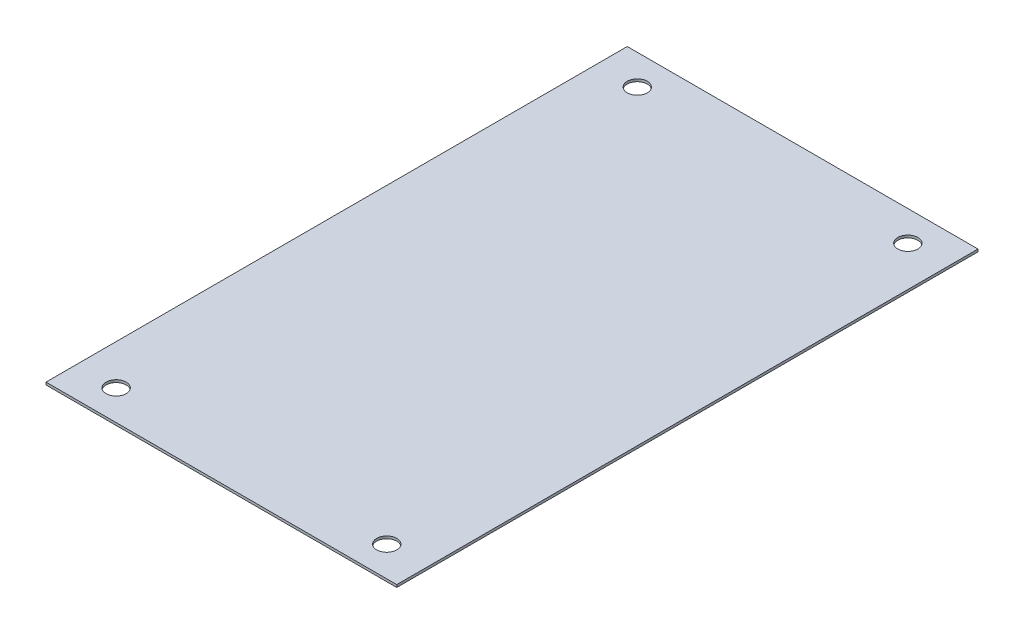
ISO-10303-21;
HEADER;
FILE_DESCRIPTION(('STEP AP214'),'2;1');
FILE_NAME('part.step','',(''),(''),'','','');
FILE_SCHEMA(('AUTOMOTIVE_DESIGN { 1 0 10303 214 1 1 1 1 }'));
ENDSEC;
DATA;
#1=APPLICATION_CONTEXT('core data for automotive mechanical design processes');
#2=APPLICATION_PROTOCOL_DEFINITION('international standard','automotive_design',2000,#1);
#3=PRODUCT_CONTEXT('',#1,'mechanical');
#4=PRODUCT('Part','Part','',(#3));
#5=PRODUCT_RELATED_PRODUCT_CATEGORY('part','',(#4));
#6=PRODUCT_DEFINITION_FORMATION('','',#4);
#7=PRODUCT_DEFINITION_CONTEXT('part definition',#1,'design');
#8=PRODUCT_DEFINITION('design','',#6,#7);
#9=PRODUCT_DEFINITION_SHAPE('','',#8);
#10=(LENGTH_UNIT() NAMED_UNIT(*) SI_UNIT(.MILLI.,.METRE.));
#11=(NAMED_UNIT(*) PLANE_ANGLE_UNIT() SI_UNIT($,.RADIAN.));
#12=(NAMED_UNIT(*) SI_UNIT($,.STERADIAN.) SOLID_ANGLE_UNIT());
#13=UNCERTAINTY_MEASURE_WITH_UNIT(LENGTH_MEASURE(1.E-05),#10,'distance_accuracy_value','');
#14=(GEOMETRIC_REPRESENTATION_CONTEXT(3) GLOBAL_UNCERTAINTY_ASSIGNED_CONTEXT((#13)) GLOBAL_UNIT_ASSIGNED_CONTEXT((#10,
#11,#12)) REPRESENTATION_CONTEXT('',''));
#15=CARTESIAN_POINT('',(0.,0.,0.));
#16=DIRECTION('',(0.,0.,1.));
#17=DIRECTION('',(1.,0.,0.));
#18=AXIS2_PLACEMENT_3D('',#15,#16,#17);
#19=CARTESIAN_POINT('',(0.,3.175,0.));
#20=DIRECTION('',(1.,0.,0.));
#21=DIRECTION('',(0.,0.,-1.));
#22=AXIS2_PLACEMENT_3D('',#19,#20,#21);
#23=PLANE('',#22);
#24=DIRECTION('',(0.,0.,1.));
#25=VECTOR('',#24,1.);
#26=CARTESIAN_POINT('',(0.,0.,0.));
#27=LINE('',#26,#25);
#28=CARTESIAN_POINT('',(0.,0.,-736.6));
#29=VERTEX_POINT('',#28);
#30=CARTESIAN_POINT('',(0.,0.,0.));
#31=VERTEX_POINT('',#30);
#32=EDGE_CURVE('E83',#29,#31,#27,.T.);
#33=ORIENTED_EDGE('',*,*,#32,.T.);
#34=DIRECTION('',(0.,-1.,0.));
#35=VECTOR('',#34,1.);
#36=CARTESIAN_POINT('',(0.,3.175,0.));
#37=LINE('',#36,#35);
#38=CARTESIAN_POINT('',(0.,3.175,0.));
#39=VERTEX_POINT('',#38);
#40=EDGE_CURVE('E11',#39,#31,#37,.T.);
#41=ORIENTED_EDGE('',*,*,#40,.F.);
#42=DIRECTION('',(0.,0.,1.));
#43=VECTOR('',#42,1.);
#44=CARTESIAN_POINT('',(0.,3.175,0.));
#45=LINE('',#44,#43);
#46=CARTESIAN_POINT('',(0.,3.175,-736.6));
#47=VERTEX_POINT('',#46);
#48=EDGE_CURVE('E70',#47,#39,#45,.T.);
#49=ORIENTED_EDGE('',*,*,#48,.F.);
#50=DIRECTION('',(0.,-1.,0.));
#51=VECTOR('',#50,1.);
#52=CARTESIAN_POINT('',(0.,3.175,-736.6));
#53=LINE('',#52,#51);
#54=EDGE_CURVE('E79',#47,#29,#53,.T.);
#55=ORIENTED_EDGE('',*,*,#54,.T.);
#56=EDGE_LOOP('',(#33,#41,#49,#55));
#57=FACE_BOUND('',#56,.T.);
#58=ADVANCED_FACE('F17',(#57),#23,.F.);
#59=CARTESIAN_POINT('',(0.,3.175,0.));
#60=DIRECTION('',(0.,0.,-1.));
#61=DIRECTION('',(-1.,0.,0.));
#62=AXIS2_PLACEMENT_3D('',#59,#60,#61);
#63=PLANE('',#62);
#64=DIRECTION('',(1.,0.,0.));
#65=VECTOR('',#64,1.);
#66=CARTESIAN_POINT('',(0.,0.,0.));
#67=LINE('',#66,#65);
#68=CARTESIAN_POINT('',(444.5,0.,0.));
#69=VERTEX_POINT('',#68);
#70=EDGE_CURVE('E74',#31,#69,#67,.T.);
#71=ORIENTED_EDGE('',*,*,#70,.T.);
#72=DIRECTION('',(0.,-1.,0.));
#73=VECTOR('',#72,1.);
#74=CARTESIAN_POINT('',(444.5,3.175,0.));
#75=LINE('',#74,#73);
#76=CARTESIAN_POINT('',(444.5,3.175,0.));
#77=VERTEX_POINT('',#76);
#78=EDGE_CURVE('E26',#77,#69,#75,.T.);
#79=ORIENTED_EDGE('',*,*,#78,.F.);
#80=DIRECTION('',(1.,0.,0.));
#81=VECTOR('',#80,1.);
#82=CARTESIAN_POINT('',(0.,3.175,0.));
#83=LINE('',#82,#81);
#84=EDGE_CURVE('E65',#39,#77,#83,.T.);
#85=ORIENTED_EDGE('',*,*,#84,.F.);
#86=ORIENTED_EDGE('',*,*,#40,.T.);
#87=EDGE_LOOP('',(#71,#79,#85,#86));
#88=FACE_BOUND('',#87,.T.);
#89=ADVANCED_FACE('F73',(#88),#63,.F.);
#90=CARTESIAN_POINT('',(444.5,3.175,0.));
#91=DIRECTION('',(-1.,0.,0.));
#92=DIRECTION('',(0.,0.,1.));
#93=AXIS2_PLACEMENT_3D('',#90,#91,#92);
#94=PLANE('',#93);
#95=DIRECTION('',(0.,0.,-1.));
#96=VECTOR('',#95,1.);
#97=CARTESIAN_POINT('',(444.5,0.,0.));
#98=LINE('',#97,#96);
#99=CARTESIAN_POINT('',(444.5,0.,-736.6));
#100=VERTEX_POINT('',#99);
#101=EDGE_CURVE('E52',#69,#100,#98,.T.);
#102=ORIENTED_EDGE('',*,*,#101,.T.);
#103=DIRECTION('',(0.,-1.,0.));
#104=VECTOR('',#103,1.);
#105=CARTESIAN_POINT('',(444.5,3.175,-736.6));
#106=LINE('',#105,#104);
#107=CARTESIAN_POINT('',(444.5,3.175,-736.6));
#108=VERTEX_POINT('',#107);
#109=EDGE_CURVE('E75',#108,#100,#106,.T.);
#110=ORIENTED_EDGE('',*,*,#109,.F.);
#111=DIRECTION('',(0.,0.,-1.));
#112=VECTOR('',#111,1.);
#113=CARTESIAN_POINT('',(444.5,3.175,0.));
#114=LINE('',#113,#112);
#115=EDGE_CURVE('E68',#77,#108,#114,.T.);
#116=ORIENTED_EDGE('',*,*,#115,.F.);
#117=ORIENTED_EDGE('',*,*,#78,.T.);
#118=EDGE_LOOP('',(#102,#110,#116,#117));
#119=FACE_BOUND('',#118,.T.);
#120=ADVANCED_FACE('F77',(#119),#94,.F.);
#121=CARTESIAN_POINT('',(0.,3.175,-736.6));
#122=DIRECTION('',(0.,0.,1.));
#123=DIRECTION('',(1.,0.,0.));
#124=AXIS2_PLACEMENT_3D('',#121,#122,#123);
#125=PLANE('',#124);
#126=DIRECTION('',(-1.,0.,0.));
#127=VECTOR('',#126,1.);
#128=CARTESIAN_POINT('',(0.,0.,-736.6));
#129=LINE('',#128,#127);
#130=EDGE_CURVE('E58',#100,#29,#129,.T.);
#131=ORIENTED_EDGE('',*,*,#130,.T.);
#132=ORIENTED_EDGE('',*,*,#54,.F.);
#133=DIRECTION('',(-1.,0.,0.));
#134=VECTOR('',#133,1.);
#135=CARTESIAN_POINT('',(0.,3.175,-736.6));
#136=LINE('',#135,#134);
#137=EDGE_CURVE('E35',#108,#47,#136,.T.);
#138=ORIENTED_EDGE('',*,*,#137,.F.);
#139=ORIENTED_EDGE('',*,*,#109,.T.);
#140=EDGE_LOOP('',(#131,#132,#138,#139));
#141=FACE_BOUND('',#140,.T.);
#142=ADVANCED_FACE('F133',(#141),#125,.F.);
#143=CARTESIAN_POINT('',(0.,3.175,-736.6));
#144=DIRECTION('',(0.,-1.,0.));
#145=DIRECTION('',(0.,0.,-1.));
#146=AXIS2_PLACEMENT_3D('',#143,#144,#145);
#147=PLANE('',#146);
#148=CARTESIAN_POINT('',(50.8,3.175,-38.1));
#149=DIRECTION('',(0.,1.,0.));
#150=DIRECTION('',(0.,0.,1.));
#151=AXIS2_PLACEMENT_3D('',#148,#149,#150);
#152=CIRCLE('',#151,12.7);
#153=CARTESIAN_POINT('',(50.8,3.175,-25.4));
#154=VERTEX_POINT('',#153);
#155=EDGE_CURVE('E112',#154,#154,#152,.T.);
#156=ORIENTED_EDGE('',*,*,#155,.F.);
#157=EDGE_LOOP('',(#156));
#158=FACE_BOUND('',#157,.T.);
#159=CARTESIAN_POINT('',(50.8,3.175,-698.5));
#160=DIRECTION('',(0.,1.,0.));
#161=DIRECTION('',(0.,0.,1.));
#162=AXIS2_PLACEMENT_3D('',#159,#160,#161);
#163=CIRCLE('',#162,12.7);
#164=CARTESIAN_POINT('',(50.8,3.175,-685.8));
#165=VERTEX_POINT('',#164);
#166=EDGE_CURVE('E109',#165,#165,#163,.T.);
#167=ORIENTED_EDGE('',*,*,#166,.F.);
#168=EDGE_LOOP('',(#167));
#169=FACE_BOUND('',#168,.T.);
#170=CARTESIAN_POINT('',(393.7,3.175,-698.5));
#171=DIRECTION('',(0.,1.,0.));
#172=DIRECTION('',(0.,0.,1.));
#173=AXIS2_PLACEMENT_3D('',#170,#171,#172);
#174=CIRCLE('',#173,12.7);
#175=CARTESIAN_POINT('',(393.7,3.175,-685.8));
#176=VERTEX_POINT('',#175);
#177=EDGE_CURVE('E101',#176,#176,#174,.T.);
#178=ORIENTED_EDGE('',*,*,#177,.F.);
#179=EDGE_LOOP('',(#178));
#180=FACE_BOUND('',#179,.T.);
#181=CARTESIAN_POINT('',(393.7,3.175,-38.1));
#182=DIRECTION('',(0.,1.,0.));
#183=DIRECTION('',(0.,0.,1.));
#184=AXIS2_PLACEMENT_3D('',#181,#182,#183);
#185=CIRCLE('',#184,12.7);
#186=CARTESIAN_POINT('',(393.7,3.175,-25.4));
#187=VERTEX_POINT('',#186);
#188=EDGE_CURVE('E92',#187,#187,#185,.T.);
#189=ORIENTED_EDGE('',*,*,#188,.F.);
#190=EDGE_LOOP('',(#189));
#191=FACE_BOUND('',#190,.T.);
#192=ORIENTED_EDGE('',*,*,#48,.T.);
#193=ORIENTED_EDGE('',*,*,#84,.T.);
#194=ORIENTED_EDGE('',*,*,#115,.T.);
#195=ORIENTED_EDGE('',*,*,#137,.T.);
#196=EDGE_LOOP('',(#192,#193,#194,#195));
#197=FACE_BOUND('',#196,.T.);
#198=ADVANCED_FACE('F66',(#158,#169,#180,#191,#197),#147,.F.);
#199=CARTESIAN_POINT('',(0.,0.,-736.6));
#200=DIRECTION('',(0.,-1.,0.));
#201=DIRECTION('',(0.,0.,-1.));
#202=AXIS2_PLACEMENT_3D('',#199,#200,#201);
#203=PLANE('',#202);
#204=CARTESIAN_POINT('',(50.8,0.,-38.1));
#205=DIRECTION('',(0.,-1.,0.));
#206=DIRECTION('',(0.,0.,-1.));
#207=AXIS2_PLACEMENT_3D('',#204,#205,#206);
#208=CIRCLE('',#207,12.7);
#209=CARTESIAN_POINT('',(50.8,0.,-50.8));
#210=VERTEX_POINT('',#209);
#211=EDGE_CURVE('E20',#210,#210,#208,.T.);
#212=ORIENTED_EDGE('',*,*,#211,.F.);
#213=EDGE_LOOP('',(#212));
#214=FACE_BOUND('',#213,.T.);
#215=CARTESIAN_POINT('',(50.8,0.,-698.5));
#216=DIRECTION('',(0.,-1.,0.));
#217=DIRECTION('',(0.,0.,-1.));
#218=AXIS2_PLACEMENT_3D('',#215,#216,#217);
#219=CIRCLE('',#218,12.7);
#220=CARTESIAN_POINT('',(50.8,0.,-711.2));
#221=VERTEX_POINT('',#220);
#222=EDGE_CURVE('E106',#221,#221,#219,.T.);
#223=ORIENTED_EDGE('',*,*,#222,.F.);
#224=EDGE_LOOP('',(#223));
#225=FACE_BOUND('',#224,.T.);
#226=CARTESIAN_POINT('',(393.7,0.,-698.5));
#227=DIRECTION('',(0.,-1.,0.));
#228=DIRECTION('',(0.,0.,-1.));
#229=AXIS2_PLACEMENT_3D('',#226,#227,#228);
#230=CIRCLE('',#229,12.7);
#231=CARTESIAN_POINT('',(393.7,0.,-711.2));
#232=VERTEX_POINT('',#231);
#233=EDGE_CURVE('E96',#232,#232,#230,.T.);
#234=ORIENTED_EDGE('',*,*,#233,.F.);
#235=EDGE_LOOP('',(#234));
#236=FACE_BOUND('',#235,.T.);
#237=CARTESIAN_POINT('',(393.7,0.,-38.1));
#238=DIRECTION('',(0.,-1.,0.));
#239=DIRECTION('',(0.,0.,-1.));
#240=AXIS2_PLACEMENT_3D('',#237,#238,#239);
#241=CIRCLE('',#240,12.7);
#242=CARTESIAN_POINT('',(393.7,0.,-50.8));
#243=VERTEX_POINT('',#242);
#244=EDGE_CURVE('E86',#243,#243,#241,.T.);
#245=ORIENTED_EDGE('',*,*,#244,.F.);
#246=EDGE_LOOP('',(#245));
#247=FACE_BOUND('',#246,.T.);
#248=ORIENTED_EDGE('',*,*,#32,.F.);
#249=ORIENTED_EDGE('',*,*,#130,.F.);
#250=ORIENTED_EDGE('',*,*,#101,.F.);
#251=ORIENTED_EDGE('',*,*,#70,.F.);
#252=EDGE_LOOP('',(#248,#249,#250,#251));
#253=FACE_BOUND('',#252,.T.);
#254=ADVANCED_FACE('F121',(#214,#225,#236,#247,#253),#203,.T.);
#255=CARTESIAN_POINT('',(393.7,3.175,-38.1));
#256=DIRECTION('',(0.,1.,0.));
#257=DIRECTION('',(0.,0.,1.));
#258=AXIS2_PLACEMENT_3D('',#255,#256,#257);
#259=CYLINDRICAL_SURFACE('',#258,12.7);
#260=ORIENTED_EDGE('',*,*,#244,.T.);
#261=EDGE_LOOP('',(#260));
#262=FACE_BOUND('',#261,.T.);
#263=ORIENTED_EDGE('',*,*,#188,.T.);
#264=EDGE_LOOP('',(#263));
#265=FACE_BOUND('',#264,.T.);
#266=ADVANCED_FACE('F124',(#262,#265),#259,.F.);
#267=CARTESIAN_POINT('',(393.7,3.175,-698.5));
#268=DIRECTION('',(0.,1.,0.));
#269=DIRECTION('',(0.,0.,1.));
#270=AXIS2_PLACEMENT_3D('',#267,#268,#269);
#271=CYLINDRICAL_SURFACE('',#270,12.7);
#272=ORIENTED_EDGE('',*,*,#233,.T.);
#273=EDGE_LOOP('',(#272));
#274=FACE_BOUND('',#273,.T.);
#275=ORIENTED_EDGE('',*,*,#177,.T.);
#276=EDGE_LOOP('',(#275));
#277=FACE_BOUND('',#276,.T.);
#278=ADVANCED_FACE('F187',(#274,#277),#271,.F.);
#279=CARTESIAN_POINT('',(50.8,3.175,-698.5));
#280=DIRECTION('',(0.,1.,0.));
#281=DIRECTION('',(0.,0.,1.));
#282=AXIS2_PLACEMENT_3D('',#279,#280,#281);
#283=CYLINDRICAL_SURFACE('',#282,12.7);
#284=ORIENTED_EDGE('',*,*,#222,.T.);
#285=EDGE_LOOP('',(#284));
#286=FACE_BOUND('',#285,.T.);
#287=ORIENTED_EDGE('',*,*,#166,.T.);
#288=EDGE_LOOP('',(#287));
#289=FACE_BOUND('',#288,.T.);
#290=ADVANCED_FACE('F196',(#286,#289),#283,.F.);
#291=CARTESIAN_POINT('',(50.8,3.175,-38.1));
#292=DIRECTION('',(0.,1.,0.));
#293=DIRECTION('',(0.,0.,1.));
#294=AXIS2_PLACEMENT_3D('',#291,#292,#293);
#295=CYLINDRICAL_SURFACE('',#294,12.7);
#296=ORIENTED_EDGE('',*,*,#211,.T.);
#297=EDGE_LOOP('',(#296));
#298=FACE_BOUND('',#297,.T.);
#299=ORIENTED_EDGE('',*,*,#155,.T.);
#300=EDGE_LOOP('',(#299));
#301=FACE_BOUND('',#300,.T.);
#302=ADVANCED_FACE('F119',(#298,#301),#295,.F.);
#303=CLOSED_SHELL('',(#58,#89,#120,#142,#198,#254,#266,#278,#290,#302));
#304=MANIFOLD_SOLID_BREP('B1',#303);
#305=ADVANCED_BREP_SHAPE_REPRESENTATION('',(#18,#304),#14);
#306=SHAPE_DEFINITION_REPRESENTATION(#9,#305);
ENDSEC;
END-ISO-10303-21;
